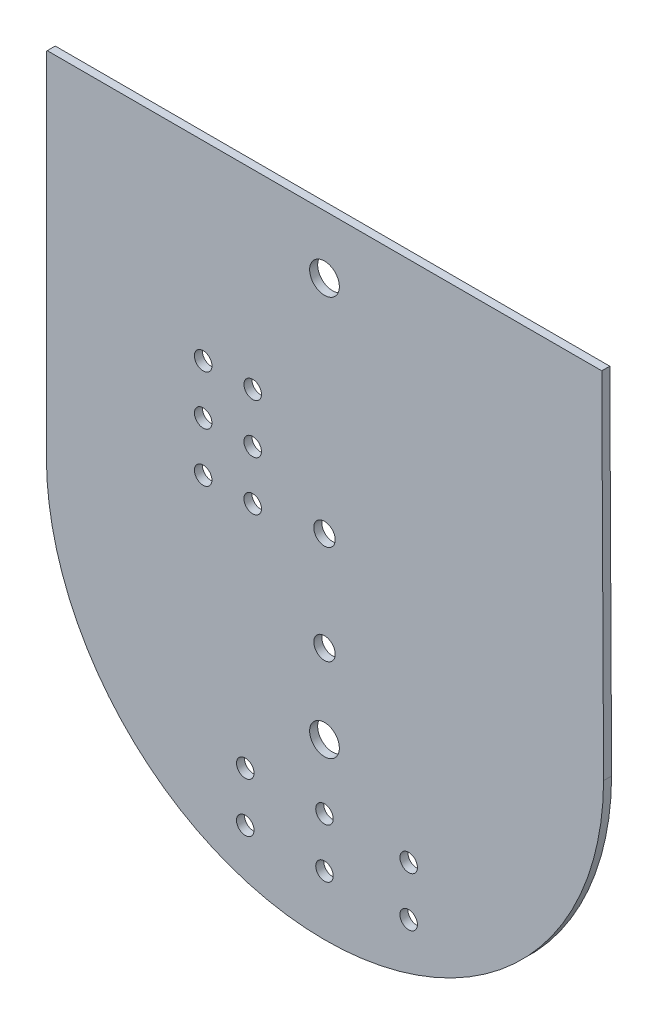
ISO-10303-21;
HEADER;
FILE_DESCRIPTION(('STEP AP214'),'2;1');
FILE_NAME('part.step','',(''),(''),'','','');
FILE_SCHEMA(('AUTOMOTIVE_DESIGN { 1 0 10303 214 1 1 1 1 }'));
ENDSEC;
DATA;
#1=APPLICATION_CONTEXT('core data for automotive mechanical design processes');
#2=APPLICATION_PROTOCOL_DEFINITION('international standard','automotive_design',2000,#1);
#3=PRODUCT_CONTEXT('',#1,'mechanical');
#4=PRODUCT('Part','Part','',(#3));
#5=PRODUCT_RELATED_PRODUCT_CATEGORY('part','',(#4));
#6=PRODUCT_DEFINITION_FORMATION('','',#4);
#7=PRODUCT_DEFINITION_CONTEXT('part definition',#1,'design');
#8=PRODUCT_DEFINITION('design','',#6,#7);
#9=PRODUCT_DEFINITION_SHAPE('','',#8);
#10=(LENGTH_UNIT() NAMED_UNIT(*) SI_UNIT(.MILLI.,.METRE.));
#11=(NAMED_UNIT(*) PLANE_ANGLE_UNIT() SI_UNIT($,.RADIAN.));
#12=(NAMED_UNIT(*) SI_UNIT($,.STERADIAN.) SOLID_ANGLE_UNIT());
#13=UNCERTAINTY_MEASURE_WITH_UNIT(LENGTH_MEASURE(1.E-05),#10,'distance_accuracy_value','');
#14=(GEOMETRIC_REPRESENTATION_CONTEXT(3) GLOBAL_UNCERTAINTY_ASSIGNED_CONTEXT((#13)) GLOBAL_UNIT_ASSIGNED_CONTEXT((#10,
#11,#12)) REPRESENTATION_CONTEXT('',''));
#15=CARTESIAN_POINT('',(0.,0.,0.));
#16=DIRECTION('',(0.,0.,1.));
#17=DIRECTION('',(1.,0.,0.));
#18=AXIS2_PLACEMENT_3D('',#15,#16,#17);
#19=CARTESIAN_POINT('',(1.100000023842,15.112999916077,0.));
#20=DIRECTION('',(0.,0.,1.));
#21=DIRECTION('',(1.,0.,0.));
#22=AXIS2_PLACEMENT_3D('',#19,#20,#21);
#23=PLANE('',#22);
#24=CARTESIAN_POINT('',(15.367,30.1498,0.));
#25=DIRECTION('',(0.,0.,-1.));
#26=DIRECTION('',(-1.,0.,0.));
#27=AXIS2_PLACEMENT_3D('',#24,#25,#26);
#28=CIRCLE('',#27,0.762);
#29=CARTESIAN_POINT('',(14.605,30.1498,0.));
#30=VERTEX_POINT('',#29);
#31=EDGE_CURVE('E152',#30,#30,#28,.T.);
#32=ORIENTED_EDGE('',*,*,#31,.T.);
#33=EDGE_LOOP('',(#32));
#34=FACE_BOUND('',#33,.T.);
#35=CARTESIAN_POINT('',(15.367,9.652,0.));
#36=DIRECTION('',(0.,0.,-1.));
#37=DIRECTION('',(-1.,0.,0.));
#38=AXIS2_PLACEMENT_3D('',#35,#36,#37);
#39=CIRCLE('',#38,0.762);
#40=CARTESIAN_POINT('',(14.605,9.652,0.));
#41=VERTEX_POINT('',#40);
#42=EDGE_CURVE('E155',#41,#41,#39,.T.);
#43=ORIENTED_EDGE('',*,*,#42,.T.);
#44=EDGE_LOOP('',(#43));
#45=FACE_BOUND('',#44,.T.);
#46=CARTESIAN_POINT('',(15.367,18.796,0.));
#47=DIRECTION('',(0.,0.,-1.));
#48=DIRECTION('',(-1.,0.,0.));
#49=AXIS2_PLACEMENT_3D('',#46,#47,#48);
#50=CIRCLE('',#49,0.5499989);
#51=CARTESIAN_POINT('',(14.8170011,18.796,0.));
#52=VERTEX_POINT('',#51);
#53=EDGE_CURVE('E158',#52,#52,#50,.T.);
#54=ORIENTED_EDGE('',*,*,#53,.T.);
#55=EDGE_LOOP('',(#54));
#56=FACE_BOUND('',#55,.T.);
#57=CARTESIAN_POINT('',(15.367,13.716,0.));
#58=DIRECTION('',(0.,0.,-1.));
#59=DIRECTION('',(-1.,0.,0.));
#60=AXIS2_PLACEMENT_3D('',#57,#58,#59);
#61=CIRCLE('',#60,0.5499989);
#62=CARTESIAN_POINT('',(14.8170011,13.716,0.));
#63=VERTEX_POINT('',#62);
#64=EDGE_CURVE('E161',#63,#63,#61,.T.);
#65=ORIENTED_EDGE('',*,*,#64,.T.);
#66=EDGE_LOOP('',(#65));
#67=FACE_BOUND('',#66,.T.);
#68=CARTESIAN_POINT('',(19.685,6.35,0.));
#69=DIRECTION('',(0.,0.,-1.));
#70=DIRECTION('',(-1.,0.,0.));
#71=AXIS2_PLACEMENT_3D('',#68,#69,#70);
#72=CIRCLE('',#71,0.4499991);
#73=CARTESIAN_POINT('',(19.2350009,6.35,0.));
#74=VERTEX_POINT('',#73);
#75=EDGE_CURVE('E164',#74,#74,#72,.T.);
#76=ORIENTED_EDGE('',*,*,#75,.T.);
#77=EDGE_LOOP('',(#76));
#78=FACE_BOUND('',#77,.T.);
#79=CARTESIAN_POINT('',(19.685,3.81,0.));
#80=DIRECTION('',(0.,0.,-1.));
#81=DIRECTION('',(-1.,0.,0.));
#82=AXIS2_PLACEMENT_3D('',#79,#80,#81);
#83=CIRCLE('',#82,0.4499991);
#84=CARTESIAN_POINT('',(19.2350009,3.81,0.));
#85=VERTEX_POINT('',#84);
#86=EDGE_CURVE('E167',#85,#85,#83,.T.);
#87=ORIENTED_EDGE('',*,*,#86,.T.);
#88=EDGE_LOOP('',(#87));
#89=FACE_BOUND('',#88,.T.);
#90=CARTESIAN_POINT('',(15.367,6.35,0.));
#91=DIRECTION('',(0.,0.,-1.));
#92=DIRECTION('',(-1.,0.,0.));
#93=AXIS2_PLACEMENT_3D('',#90,#91,#92);
#94=CIRCLE('',#93,0.4499991);
#95=CARTESIAN_POINT('',(14.9170009,6.35,0.));
#96=VERTEX_POINT('',#95);
#97=EDGE_CURVE('E170',#96,#96,#94,.T.);
#98=ORIENTED_EDGE('',*,*,#97,.T.);
#99=EDGE_LOOP('',(#98));
#100=FACE_BOUND('',#99,.T.);
#101=CARTESIAN_POINT('',(15.367,3.81,0.));
#102=DIRECTION('',(0.,0.,-1.));
#103=DIRECTION('',(-1.,0.,0.));
#104=AXIS2_PLACEMENT_3D('',#101,#102,#103);
#105=CIRCLE('',#104,0.4499991);
#106=CARTESIAN_POINT('',(14.9170009,3.81,0.));
#107=VERTEX_POINT('',#106);
#108=EDGE_CURVE('E173',#107,#107,#105,.T.);
#109=ORIENTED_EDGE('',*,*,#108,.T.);
#110=EDGE_LOOP('',(#109));
#111=FACE_BOUND('',#110,.T.);
#112=CARTESIAN_POINT('',(11.684,23.368,0.));
#113=DIRECTION('',(0.,0.,-1.));
#114=DIRECTION('',(-1.,0.,0.));
#115=AXIS2_PLACEMENT_3D('',#112,#113,#114);
#116=CIRCLE('',#115,0.4499991);
#117=CARTESIAN_POINT('',(11.2340009,23.368,0.));
#118=VERTEX_POINT('',#117);
#119=EDGE_CURVE('E176',#118,#118,#116,.T.);
#120=ORIENTED_EDGE('',*,*,#119,.T.);
#121=EDGE_LOOP('',(#120));
#122=FACE_BOUND('',#121,.T.);
#123=CARTESIAN_POINT('',(11.684,20.828,0.));
#124=DIRECTION('',(0.,0.,-1.));
#125=DIRECTION('',(-1.,0.,0.));
#126=AXIS2_PLACEMENT_3D('',#123,#124,#125);
#127=CIRCLE('',#126,0.4499991);
#128=CARTESIAN_POINT('',(11.2340009,20.828,0.));
#129=VERTEX_POINT('',#128);
#130=EDGE_CURVE('E179',#129,#129,#127,.T.);
#131=ORIENTED_EDGE('',*,*,#130,.T.);
#132=EDGE_LOOP('',(#131));
#133=FACE_BOUND('',#132,.T.);
#134=CARTESIAN_POINT('',(9.144,23.368,0.));
#135=DIRECTION('',(0.,0.,-1.));
#136=DIRECTION('',(-1.,0.,0.));
#137=AXIS2_PLACEMENT_3D('',#134,#135,#136);
#138=CIRCLE('',#137,0.4499991);
#139=CARTESIAN_POINT('',(8.6940009,23.368,0.));
#140=VERTEX_POINT('',#139);
#141=EDGE_CURVE('E182',#140,#140,#138,.T.);
#142=ORIENTED_EDGE('',*,*,#141,.T.);
#143=EDGE_LOOP('',(#142));
#144=FACE_BOUND('',#143,.T.);
#145=CARTESIAN_POINT('',(9.144,20.828,0.));
#146=DIRECTION('',(0.,0.,-1.));
#147=DIRECTION('',(-1.,0.,0.));
#148=AXIS2_PLACEMENT_3D('',#145,#146,#147);
#149=CIRCLE('',#148,0.4499991);
#150=CARTESIAN_POINT('',(8.6940009,20.828,0.));
#151=VERTEX_POINT('',#150);
#152=EDGE_CURVE('E185',#151,#151,#149,.T.);
#153=ORIENTED_EDGE('',*,*,#152,.T.);
#154=EDGE_LOOP('',(#153));
#155=FACE_BOUND('',#154,.T.);
#156=CARTESIAN_POINT('',(11.684,18.288,0.));
#157=DIRECTION('',(0.,0.,-1.));
#158=DIRECTION('',(-1.,0.,0.));
#159=AXIS2_PLACEMENT_3D('',#156,#157,#158);
#160=CIRCLE('',#159,0.4499991);
#161=CARTESIAN_POINT('',(11.2340009,18.288,0.));
#162=VERTEX_POINT('',#161);
#163=EDGE_CURVE('E188',#162,#162,#160,.T.);
#164=ORIENTED_EDGE('',*,*,#163,.T.);
#165=EDGE_LOOP('',(#164));
#166=FACE_BOUND('',#165,.T.);
#167=CARTESIAN_POINT('',(11.303,3.81,0.));
#168=DIRECTION('',(0.,0.,-1.));
#169=DIRECTION('',(-1.,0.,0.));
#170=AXIS2_PLACEMENT_3D('',#167,#168,#169);
#171=CIRCLE('',#170,0.4499991);
#172=CARTESIAN_POINT('',(10.8530009,3.81,0.));
#173=VERTEX_POINT('',#172);
#174=EDGE_CURVE('E191',#173,#173,#171,.T.);
#175=ORIENTED_EDGE('',*,*,#174,.T.);
#176=EDGE_LOOP('',(#175));
#177=FACE_BOUND('',#176,.T.);
#178=CARTESIAN_POINT('',(9.144,18.288,0.));
#179=DIRECTION('',(0.,0.,-1.));
#180=DIRECTION('',(-1.,0.,0.));
#181=AXIS2_PLACEMENT_3D('',#178,#179,#180);
#182=CIRCLE('',#181,0.4499991);
#183=CARTESIAN_POINT('',(8.6940009,18.288,0.));
#184=VERTEX_POINT('',#183);
#185=EDGE_CURVE('E194',#184,#184,#182,.T.);
#186=ORIENTED_EDGE('',*,*,#185,.T.);
#187=EDGE_LOOP('',(#186));
#188=FACE_BOUND('',#187,.T.);
#189=CARTESIAN_POINT('',(11.303,6.35,0.));
#190=DIRECTION('',(0.,0.,-1.));
#191=DIRECTION('',(-1.,0.,0.));
#192=AXIS2_PLACEMENT_3D('',#189,#190,#191);
#193=CIRCLE('',#192,0.4499991);
#194=CARTESIAN_POINT('',(10.8530009,6.35,0.));
#195=VERTEX_POINT('',#194);
#196=EDGE_CURVE('E196',#195,#195,#193,.T.);
#197=ORIENTED_EDGE('',*,*,#196,.T.);
#198=EDGE_LOOP('',(#197));
#199=FACE_BOUND('',#198,.T.);
#200=DIRECTION('',(-0.707112662169091,-0.707100900155091,0.));
#201=VECTOR('',#200,1.);
#202=CARTESIAN_POINT('',(1.100000023842,33.104000091553,0.));
#203=LINE('',#202,#201);
#204=CARTESIAN_POINT('',(1.100000023842,33.104000091553,0.));
#205=VERTEX_POINT('',#204);
#206=CARTESIAN_POINT('',(1.14300000667597,33.146999359131,0.));
#207=VERTEX_POINT('',#206);
#208=EDGE_CURVE('E70',#205,#207,#203,.F.);
#209=ORIENTED_EDGE('',*,*,#208,.F.);
#210=DIRECTION('',(0.,1.,0.));
#211=VECTOR('',#210,1.);
#212=CARTESIAN_POINT('',(1.100000023842,15.112999916077,0.));
#213=LINE('',#212,#211);
#214=CARTESIAN_POINT('',(1.10000002384247,15.050000190735,0.));
#215=VERTEX_POINT('',#214);
#216=EDGE_CURVE('E66',#215,#205,#213,.T.);
#217=ORIENTED_EDGE('',*,*,#216,.F.);
#218=CARTESIAN_POINT('',(15.392570345692,15.049533246585,0.));
#219=DIRECTION('',(0.,0.,-1.));
#220=DIRECTION('',(-1.,0.,0.));
#221=AXIS2_PLACEMENT_3D('',#218,#219,#220);
#222=CIRCLE('',#221,14.292570329477);
#223=CARTESIAN_POINT('',(29.684999465942,14.9860000610113,0.));
#224=VERTEX_POINT('',#223);
#225=EDGE_CURVE('E19',#224,#215,#222,.T.);
#226=ORIENTED_EDGE('',*,*,#225,.F.);
#227=DIRECTION('',(-0.00517584974365303,0.999986605200005,0.));
#228=VECTOR('',#227,1.);
#229=CARTESIAN_POINT('',(29.590999603271,33.146999359131,0.));
#230=LINE('',#229,#228);
#231=CARTESIAN_POINT('',(29.590999603271,33.146999359131,0.));
#232=VERTEX_POINT('',#231);
#233=EDGE_CURVE('E61',#232,#224,#230,.F.);
#234=ORIENTED_EDGE('',*,*,#233,.F.);
#235=DIRECTION('',(1.,0.,0.));
#236=VECTOR('',#235,1.);
#237=CARTESIAN_POINT('',(1.143000006676,33.146999359131,0.));
#238=LINE('',#237,#236);
#239=EDGE_CURVE('E93',#207,#232,#238,.T.);
#240=ORIENTED_EDGE('',*,*,#239,.F.);
#241=EDGE_LOOP('',(#209,#217,#226,#234,#240));
#242=FACE_BOUND('',#241,.T.);
#243=ADVANCED_FACE('F16',(#34,#45,#56,#67,#78,#89,#100,#111,#122,#133,#144,#155,#166,#177,#188,
#199,#242),#23,.T.);
#244=CARTESIAN_POINT('',(15.392570345692,15.049533246585,-0.41148));
#245=DIRECTION('',(0.,0.,-1.));
#246=DIRECTION('',(-1.,0.,0.));
#247=AXIS2_PLACEMENT_3D('',#244,#245,#246);
#248=CYLINDRICAL_SURFACE('',#247,14.292570329477);
#249=DIRECTION('',(0.,0.,-1.));
#250=VECTOR('',#249,1.);
#251=CARTESIAN_POINT('',(1.10000002384263,15.050000190735,-0.41148));
#252=LINE('',#251,#250);
#253=CARTESIAN_POINT('',(1.10000002384247,15.050000190735,-0.41148));
#254=VERTEX_POINT('',#253);
#255=EDGE_CURVE('E80',#215,#254,#252,.T.);
#256=ORIENTED_EDGE('',*,*,#255,.T.);
#257=CARTESIAN_POINT('',(15.392570345692,15.049533246585,-0.41148));
#258=DIRECTION('',(0.,0.,-1.));
#259=DIRECTION('',(-1.,0.,0.));
#260=AXIS2_PLACEMENT_3D('',#257,#258,#259);
#261=CIRCLE('',#260,14.292570329477);
#262=CARTESIAN_POINT('',(29.684999465942,14.9860000610168,-0.41148));
#263=VERTEX_POINT('',#262);
#264=EDGE_CURVE('E149',#254,#263,#261,.F.);
#265=ORIENTED_EDGE('',*,*,#264,.T.);
#266=DIRECTION('',(0.,0.,1.));
#267=VECTOR('',#266,1.);
#268=CARTESIAN_POINT('',(29.6849994659419,14.986000061035,-0.41148));
#269=LINE('',#268,#267);
#270=EDGE_CURVE('E81',#224,#263,#269,.F.);
#271=ORIENTED_EDGE('',*,*,#270,.F.);
#272=ORIENTED_EDGE('',*,*,#225,.T.);
#273=EDGE_LOOP('',(#256,#265,#271,#272));
#274=FACE_BOUND('',#273,.T.);
#275=ADVANCED_FACE('F78',(#274),#248,.T.);
#276=CARTESIAN_POINT('',(29.590999603271,33.146999359131,-0.41148));
#277=DIRECTION('',(0.999986605200005,0.00517584974365303,0.));
#278=DIRECTION('',(-0.00517584974365303,0.999986605200005,0.));
#279=AXIS2_PLACEMENT_3D('',#276,#277,#278);
#280=PLANE('',#279);
#281=ORIENTED_EDGE('',*,*,#270,.T.);
#282=DIRECTION('',(-0.00517584974365881,0.999986605200005,0.));
#283=VECTOR('',#282,1.);
#284=CARTESIAN_POINT('',(29.684999465942,14.986000061035,-0.41148));
#285=LINE('',#284,#283);
#286=CARTESIAN_POINT('',(29.590999603271,33.146999359131,-0.41148));
#287=VERTEX_POINT('',#286);
#288=EDGE_CURVE('E151',#263,#287,#285,.T.);
#289=ORIENTED_EDGE('',*,*,#288,.T.);
#290=DIRECTION('',(0.,0.,1.));
#291=VECTOR('',#290,1.);
#292=CARTESIAN_POINT('',(29.590999603271,33.146999359131,-0.41148));
#293=LINE('',#292,#291);
#294=EDGE_CURVE('E95',#232,#287,#293,.F.);
#295=ORIENTED_EDGE('',*,*,#294,.F.);
#296=ORIENTED_EDGE('',*,*,#233,.T.);
#297=EDGE_LOOP('',(#281,#289,#295,#296));
#298=FACE_BOUND('',#297,.T.);
#299=ADVANCED_FACE('F218',(#298),#280,.T.);
#300=CARTESIAN_POINT('',(1.143000006676,33.146999359131,-0.41148));
#301=DIRECTION('',(0.,1.,0.));
#302=DIRECTION('',(0.,0.,1.));
#303=AXIS2_PLACEMENT_3D('',#300,#301,#302);
#304=PLANE('',#303);
#305=ORIENTED_EDGE('',*,*,#294,.T.);
#306=DIRECTION('',(1.,0.,0.));
#307=VECTOR('',#306,1.);
#308=CARTESIAN_POINT('',(1.100000023842,33.146999359131,-0.41148));
#309=LINE('',#308,#307);
#310=CARTESIAN_POINT('',(1.14300000667597,33.146999359131,-0.41148));
#311=VERTEX_POINT('',#310);
#312=EDGE_CURVE('E207',#287,#311,#309,.F.);
#313=ORIENTED_EDGE('',*,*,#312,.T.);
#314=DIRECTION('',(0.,0.,1.));
#315=VECTOR('',#314,1.);
#316=CARTESIAN_POINT('',(1.14300000667588,33.1469993591311,-0.41148));
#317=LINE('',#316,#315);
#318=EDGE_CURVE('E75',#207,#311,#317,.F.);
#319=ORIENTED_EDGE('',*,*,#318,.F.);
#320=ORIENTED_EDGE('',*,*,#239,.T.);
#321=EDGE_LOOP('',(#305,#313,#319,#320));
#322=FACE_BOUND('',#321,.T.);
#323=ADVANCED_FACE('F213',(#322),#304,.T.);
#324=CARTESIAN_POINT('',(1.100000023842,33.104000091553,-0.41148));
#325=DIRECTION('',(-0.707100900155091,0.707112662169091,0.));
#326=DIRECTION('',(-0.707112662169091,-0.707100900155091,0.));
#327=AXIS2_PLACEMENT_3D('',#324,#325,#326);
#328=PLANE('',#327);
#329=ORIENTED_EDGE('',*,*,#318,.T.);
#330=DIRECTION('',(-0.707112662171089,-0.707100900153094,0.));
#331=VECTOR('',#330,1.);
#332=CARTESIAN_POINT('',(1.143000006676,33.146999359131,-0.41148));
#333=LINE('',#332,#331);
#334=CARTESIAN_POINT('',(1.100000023842,33.104000091553,-0.41148));
#335=VERTEX_POINT('',#334);
#336=EDGE_CURVE('E148',#311,#335,#333,.T.);
#337=ORIENTED_EDGE('',*,*,#336,.T.);
#338=DIRECTION('',(0.,0.,1.));
#339=VECTOR('',#338,1.);
#340=CARTESIAN_POINT('',(1.100000023842,33.104000091553,-0.41148));
#341=LINE('',#340,#339);
#342=EDGE_CURVE('E74',#205,#335,#341,.F.);
#343=ORIENTED_EDGE('',*,*,#342,.F.);
#344=ORIENTED_EDGE('',*,*,#208,.T.);
#345=EDGE_LOOP('',(#329,#337,#343,#344));
#346=FACE_BOUND('',#345,.T.);
#347=ADVANCED_FACE('F224',(#346),#328,.T.);
#348=CARTESIAN_POINT('',(1.100000023842,15.112999916077,-0.41148));
#349=DIRECTION('',(-1.,0.,0.));
#350=DIRECTION('',(0.,0.,1.));
#351=AXIS2_PLACEMENT_3D('',#348,#349,#350);
#352=PLANE('',#351);
#353=ORIENTED_EDGE('',*,*,#342,.T.);
#354=DIRECTION('',(0.,1.,0.));
#355=VECTOR('',#354,1.);
#356=CARTESIAN_POINT('',(1.100000023842,15.112999916077,-0.41148));
#357=LINE('',#356,#355);
#358=EDGE_CURVE('E34',#335,#254,#357,.F.);
#359=ORIENTED_EDGE('',*,*,#358,.T.);
#360=ORIENTED_EDGE('',*,*,#255,.F.);
#361=ORIENTED_EDGE('',*,*,#216,.T.);
#362=EDGE_LOOP('',(#353,#359,#360,#361));
#363=FACE_BOUND('',#362,.T.);
#364=ADVANCED_FACE('F82',(#363),#352,.T.);
#365=CARTESIAN_POINT('',(11.303,6.35,-0.41148));
#366=DIRECTION('',(0.,0.,-1.));
#367=DIRECTION('',(-1.,0.,0.));
#368=AXIS2_PLACEMENT_3D('',#365,#366,#367);
#369=CYLINDRICAL_SURFACE('',#368,0.4499991);
#370=ORIENTED_EDGE('',*,*,#196,.F.);
#371=EDGE_LOOP('',(#370));
#372=FACE_BOUND('',#371,.T.);
#373=CARTESIAN_POINT('',(11.303,6.35,-0.41148));
#374=DIRECTION('',(0.,0.,-1.));
#375=DIRECTION('',(-1.,0.,0.));
#376=AXIS2_PLACEMENT_3D('',#373,#374,#375);
#377=CIRCLE('',#376,0.4499991);
#378=CARTESIAN_POINT('',(10.8530009,6.35,-0.41148));
#379=VERTEX_POINT('',#378);
#380=EDGE_CURVE('E145',#379,#379,#377,.T.);
#381=ORIENTED_EDGE('',*,*,#380,.T.);
#382=EDGE_LOOP('',(#381));
#383=FACE_BOUND('',#382,.T.);
#384=ADVANCED_FACE('F232',(#372,#383),#369,.F.);
#385=CARTESIAN_POINT('',(9.144,18.288,-0.41148));
#386=DIRECTION('',(0.,0.,-1.));
#387=DIRECTION('',(-1.,0.,0.));
#388=AXIS2_PLACEMENT_3D('',#385,#386,#387);
#389=CYLINDRICAL_SURFACE('',#388,0.4499991);
#390=ORIENTED_EDGE('',*,*,#185,.F.);
#391=EDGE_LOOP('',(#390));
#392=FACE_BOUND('',#391,.T.);
#393=CARTESIAN_POINT('',(9.144,18.288,-0.41148));
#394=DIRECTION('',(0.,0.,-1.));
#395=DIRECTION('',(-1.,0.,0.));
#396=AXIS2_PLACEMENT_3D('',#393,#394,#395);
#397=CIRCLE('',#396,0.4499991);
#398=CARTESIAN_POINT('',(8.6940009,18.288,-0.41148));
#399=VERTEX_POINT('',#398);
#400=EDGE_CURVE('E142',#399,#399,#397,.T.);
#401=ORIENTED_EDGE('',*,*,#400,.T.);
#402=EDGE_LOOP('',(#401));
#403=FACE_BOUND('',#402,.T.);
#404=ADVANCED_FACE('F298',(#392,#403),#389,.F.);
#405=CARTESIAN_POINT('',(11.303,3.81,-0.41148));
#406=DIRECTION('',(0.,0.,-1.));
#407=DIRECTION('',(-1.,0.,0.));
#408=AXIS2_PLACEMENT_3D('',#405,#406,#407);
#409=CYLINDRICAL_SURFACE('',#408,0.4499991);
#410=ORIENTED_EDGE('',*,*,#174,.F.);
#411=EDGE_LOOP('',(#410));
#412=FACE_BOUND('',#411,.T.);
#413=CARTESIAN_POINT('',(11.303,3.81,-0.41148));
#414=DIRECTION('',(0.,0.,-1.));
#415=DIRECTION('',(-1.,0.,0.));
#416=AXIS2_PLACEMENT_3D('',#413,#414,#415);
#417=CIRCLE('',#416,0.4499991);
#418=CARTESIAN_POINT('',(10.8530009,3.81,-0.41148));
#419=VERTEX_POINT('',#418);
#420=EDGE_CURVE('E139',#419,#419,#417,.T.);
#421=ORIENTED_EDGE('',*,*,#420,.T.);
#422=EDGE_LOOP('',(#421));
#423=FACE_BOUND('',#422,.T.);
#424=ADVANCED_FACE('F294',(#412,#423),#409,.F.);
#425=CARTESIAN_POINT('',(11.684,18.288,-0.41148));
#426=DIRECTION('',(0.,0.,-1.));
#427=DIRECTION('',(-1.,0.,0.));
#428=AXIS2_PLACEMENT_3D('',#425,#426,#427);
#429=CYLINDRICAL_SURFACE('',#428,0.4499991);
#430=ORIENTED_EDGE('',*,*,#163,.F.);
#431=EDGE_LOOP('',(#430));
#432=FACE_BOUND('',#431,.T.);
#433=CARTESIAN_POINT('',(11.684,18.288,-0.41148));
#434=DIRECTION('',(0.,0.,-1.));
#435=DIRECTION('',(-1.,0.,0.));
#436=AXIS2_PLACEMENT_3D('',#433,#434,#435);
#437=CIRCLE('',#436,0.4499991);
#438=CARTESIAN_POINT('',(11.2340009,18.288,-0.41148));
#439=VERTEX_POINT('',#438);
#440=EDGE_CURVE('E136',#439,#439,#437,.T.);
#441=ORIENTED_EDGE('',*,*,#440,.T.);
#442=EDGE_LOOP('',(#441));
#443=FACE_BOUND('',#442,.T.);
#444=ADVANCED_FACE('F290',(#432,#443),#429,.F.);
#445=CARTESIAN_POINT('',(9.144,20.828,-0.41148));
#446=DIRECTION('',(0.,0.,-1.));
#447=DIRECTION('',(-1.,0.,0.));
#448=AXIS2_PLACEMENT_3D('',#445,#446,#447);
#449=CYLINDRICAL_SURFACE('',#448,0.4499991);
#450=ORIENTED_EDGE('',*,*,#152,.F.);
#451=EDGE_LOOP('',(#450));
#452=FACE_BOUND('',#451,.T.);
#453=CARTESIAN_POINT('',(9.144,20.828,-0.41148));
#454=DIRECTION('',(0.,0.,-1.));
#455=DIRECTION('',(-1.,0.,0.));
#456=AXIS2_PLACEMENT_3D('',#453,#454,#455);
#457=CIRCLE('',#456,0.4499991);
#458=CARTESIAN_POINT('',(8.6940009,20.828,-0.41148));
#459=VERTEX_POINT('',#458);
#460=EDGE_CURVE('E133',#459,#459,#457,.T.);
#461=ORIENTED_EDGE('',*,*,#460,.T.);
#462=EDGE_LOOP('',(#461));
#463=FACE_BOUND('',#462,.T.);
#464=ADVANCED_FACE('F286',(#452,#463),#449,.F.);
#465=CARTESIAN_POINT('',(9.144,23.368,-0.41148));
#466=DIRECTION('',(0.,0.,-1.));
#467=DIRECTION('',(-1.,0.,0.));
#468=AXIS2_PLACEMENT_3D('',#465,#466,#467);
#469=CYLINDRICAL_SURFACE('',#468,0.4499991);
#470=ORIENTED_EDGE('',*,*,#141,.F.);
#471=EDGE_LOOP('',(#470));
#472=FACE_BOUND('',#471,.T.);
#473=CARTESIAN_POINT('',(9.144,23.368,-0.41148));
#474=DIRECTION('',(0.,0.,-1.));
#475=DIRECTION('',(-1.,0.,0.));
#476=AXIS2_PLACEMENT_3D('',#473,#474,#475);
#477=CIRCLE('',#476,0.4499991);
#478=CARTESIAN_POINT('',(8.6940009,23.368,-0.41148));
#479=VERTEX_POINT('',#478);
#480=EDGE_CURVE('E130',#479,#479,#477,.T.);
#481=ORIENTED_EDGE('',*,*,#480,.T.);
#482=EDGE_LOOP('',(#481));
#483=FACE_BOUND('',#482,.T.);
#484=ADVANCED_FACE('F282',(#472,#483),#469,.F.);
#485=CARTESIAN_POINT('',(11.684,20.828,-0.41148));
#486=DIRECTION('',(0.,0.,-1.));
#487=DIRECTION('',(-1.,0.,0.));
#488=AXIS2_PLACEMENT_3D('',#485,#486,#487);
#489=CYLINDRICAL_SURFACE('',#488,0.4499991);
#490=ORIENTED_EDGE('',*,*,#130,.F.);
#491=EDGE_LOOP('',(#490));
#492=FACE_BOUND('',#491,.T.);
#493=CARTESIAN_POINT('',(11.684,20.828,-0.41148));
#494=DIRECTION('',(0.,0.,-1.));
#495=DIRECTION('',(-1.,0.,0.));
#496=AXIS2_PLACEMENT_3D('',#493,#494,#495);
#497=CIRCLE('',#496,0.4499991);
#498=CARTESIAN_POINT('',(11.2340009,20.828,-0.41148));
#499=VERTEX_POINT('',#498);
#500=EDGE_CURVE('E127',#499,#499,#497,.T.);
#501=ORIENTED_EDGE('',*,*,#500,.T.);
#502=EDGE_LOOP('',(#501));
#503=FACE_BOUND('',#502,.T.);
#504=ADVANCED_FACE('F278',(#492,#503),#489,.F.);
#505=CARTESIAN_POINT('',(11.684,23.368,-0.41148));
#506=DIRECTION('',(0.,0.,-1.));
#507=DIRECTION('',(-1.,0.,0.));
#508=AXIS2_PLACEMENT_3D('',#505,#506,#507);
#509=CYLINDRICAL_SURFACE('',#508,0.4499991);
#510=ORIENTED_EDGE('',*,*,#119,.F.);
#511=EDGE_LOOP('',(#510));
#512=FACE_BOUND('',#511,.T.);
#513=CARTESIAN_POINT('',(11.684,23.368,-0.41148));
#514=DIRECTION('',(0.,0.,-1.));
#515=DIRECTION('',(-1.,0.,0.));
#516=AXIS2_PLACEMENT_3D('',#513,#514,#515);
#517=CIRCLE('',#516,0.4499991);
#518=CARTESIAN_POINT('',(11.2340009,23.368,-0.41148));
#519=VERTEX_POINT('',#518);
#520=EDGE_CURVE('E124',#519,#519,#517,.T.);
#521=ORIENTED_EDGE('',*,*,#520,.T.);
#522=EDGE_LOOP('',(#521));
#523=FACE_BOUND('',#522,.T.);
#524=ADVANCED_FACE('F274',(#512,#523),#509,.F.);
#525=CARTESIAN_POINT('',(15.367,3.81,-0.41148));
#526=DIRECTION('',(0.,0.,-1.));
#527=DIRECTION('',(-1.,0.,0.));
#528=AXIS2_PLACEMENT_3D('',#525,#526,#527);
#529=CYLINDRICAL_SURFACE('',#528,0.4499991);
#530=ORIENTED_EDGE('',*,*,#108,.F.);
#531=EDGE_LOOP('',(#530));
#532=FACE_BOUND('',#531,.T.);
#533=CARTESIAN_POINT('',(15.367,3.81,-0.41148));
#534=DIRECTION('',(0.,0.,-1.));
#535=DIRECTION('',(-1.,0.,0.));
#536=AXIS2_PLACEMENT_3D('',#533,#534,#535);
#537=CIRCLE('',#536,0.4499991);
#538=CARTESIAN_POINT('',(14.9170009,3.81,-0.41148));
#539=VERTEX_POINT('',#538);
#540=EDGE_CURVE('E121',#539,#539,#537,.T.);
#541=ORIENTED_EDGE('',*,*,#540,.T.);
#542=EDGE_LOOP('',(#541));
#543=FACE_BOUND('',#542,.T.);
#544=ADVANCED_FACE('F270',(#532,#543),#529,.F.);
#545=CARTESIAN_POINT('',(15.367,6.35,-0.41148));
#546=DIRECTION('',(0.,0.,-1.));
#547=DIRECTION('',(-1.,0.,0.));
#548=AXIS2_PLACEMENT_3D('',#545,#546,#547);
#549=CYLINDRICAL_SURFACE('',#548,0.4499991);
#550=ORIENTED_EDGE('',*,*,#97,.F.);
#551=EDGE_LOOP('',(#550));
#552=FACE_BOUND('',#551,.T.);
#553=CARTESIAN_POINT('',(15.367,6.35,-0.41148));
#554=DIRECTION('',(0.,0.,-1.));
#555=DIRECTION('',(-1.,0.,0.));
#556=AXIS2_PLACEMENT_3D('',#553,#554,#555);
#557=CIRCLE('',#556,0.4499991);
#558=CARTESIAN_POINT('',(14.9170009,6.35,-0.41148));
#559=VERTEX_POINT('',#558);
#560=EDGE_CURVE('E118',#559,#559,#557,.T.);
#561=ORIENTED_EDGE('',*,*,#560,.T.);
#562=EDGE_LOOP('',(#561));
#563=FACE_BOUND('',#562,.T.);
#564=ADVANCED_FACE('F266',(#552,#563),#549,.F.);
#565=CARTESIAN_POINT('',(19.685,3.81,-0.41148));
#566=DIRECTION('',(0.,0.,-1.));
#567=DIRECTION('',(-1.,0.,0.));
#568=AXIS2_PLACEMENT_3D('',#565,#566,#567);
#569=CYLINDRICAL_SURFACE('',#568,0.4499991);
#570=ORIENTED_EDGE('',*,*,#86,.F.);
#571=EDGE_LOOP('',(#570));
#572=FACE_BOUND('',#571,.T.);
#573=CARTESIAN_POINT('',(19.685,3.81,-0.41148));
#574=DIRECTION('',(0.,0.,-1.));
#575=DIRECTION('',(-1.,0.,0.));
#576=AXIS2_PLACEMENT_3D('',#573,#574,#575);
#577=CIRCLE('',#576,0.4499991);
#578=CARTESIAN_POINT('',(19.2350009,3.81,-0.41148));
#579=VERTEX_POINT('',#578);
#580=EDGE_CURVE('E115',#579,#579,#577,.T.);
#581=ORIENTED_EDGE('',*,*,#580,.T.);
#582=EDGE_LOOP('',(#581));
#583=FACE_BOUND('',#582,.T.);
#584=ADVANCED_FACE('F262',(#572,#583),#569,.F.);
#585=CARTESIAN_POINT('',(19.685,6.35,-0.41148));
#586=DIRECTION('',(0.,0.,-1.));
#587=DIRECTION('',(-1.,0.,0.));
#588=AXIS2_PLACEMENT_3D('',#585,#586,#587);
#589=CYLINDRICAL_SURFACE('',#588,0.4499991);
#590=ORIENTED_EDGE('',*,*,#75,.F.);
#591=EDGE_LOOP('',(#590));
#592=FACE_BOUND('',#591,.T.);
#593=CARTESIAN_POINT('',(19.685,6.35,-0.41148));
#594=DIRECTION('',(0.,0.,-1.));
#595=DIRECTION('',(-1.,0.,0.));
#596=AXIS2_PLACEMENT_3D('',#593,#594,#595);
#597=CIRCLE('',#596,0.4499991);
#598=CARTESIAN_POINT('',(19.2350009,6.35,-0.41148));
#599=VERTEX_POINT('',#598);
#600=EDGE_CURVE('E112',#599,#599,#597,.T.);
#601=ORIENTED_EDGE('',*,*,#600,.T.);
#602=EDGE_LOOP('',(#601));
#603=FACE_BOUND('',#602,.T.);
#604=ADVANCED_FACE('F258',(#592,#603),#589,.F.);
#605=CARTESIAN_POINT('',(15.367,13.716,-0.41148));
#606=DIRECTION('',(0.,0.,-1.));
#607=DIRECTION('',(-1.,0.,0.));
#608=AXIS2_PLACEMENT_3D('',#605,#606,#607);
#609=CYLINDRICAL_SURFACE('',#608,0.5499989);
#610=ORIENTED_EDGE('',*,*,#64,.F.);
#611=EDGE_LOOP('',(#610));
#612=FACE_BOUND('',#611,.T.);
#613=CARTESIAN_POINT('',(15.367,13.716,-0.41148));
#614=DIRECTION('',(0.,0.,-1.));
#615=DIRECTION('',(-1.,0.,0.));
#616=AXIS2_PLACEMENT_3D('',#613,#614,#615);
#617=CIRCLE('',#616,0.5499989);
#618=CARTESIAN_POINT('',(14.8170011,13.716,-0.41148));
#619=VERTEX_POINT('',#618);
#620=EDGE_CURVE('E109',#619,#619,#617,.T.);
#621=ORIENTED_EDGE('',*,*,#620,.T.);
#622=EDGE_LOOP('',(#621));
#623=FACE_BOUND('',#622,.T.);
#624=ADVANCED_FACE('F254',(#612,#623),#609,.F.);
#625=CARTESIAN_POINT('',(15.367,18.796,-0.41148));
#626=DIRECTION('',(0.,0.,-1.));
#627=DIRECTION('',(-1.,0.,0.));
#628=AXIS2_PLACEMENT_3D('',#625,#626,#627);
#629=CYLINDRICAL_SURFACE('',#628,0.5499989);
#630=ORIENTED_EDGE('',*,*,#53,.F.);
#631=EDGE_LOOP('',(#630));
#632=FACE_BOUND('',#631,.T.);
#633=CARTESIAN_POINT('',(15.367,18.796,-0.41148));
#634=DIRECTION('',(0.,0.,-1.));
#635=DIRECTION('',(-1.,0.,0.));
#636=AXIS2_PLACEMENT_3D('',#633,#634,#635);
#637=CIRCLE('',#636,0.5499989);
#638=CARTESIAN_POINT('',(14.8170011,18.796,-0.41148));
#639=VERTEX_POINT('',#638);
#640=EDGE_CURVE('E106',#639,#639,#637,.T.);
#641=ORIENTED_EDGE('',*,*,#640,.T.);
#642=EDGE_LOOP('',(#641));
#643=FACE_BOUND('',#642,.T.);
#644=ADVANCED_FACE('F250',(#632,#643),#629,.F.);
#645=CARTESIAN_POINT('',(15.367,9.652,-0.41148));
#646=DIRECTION('',(0.,0.,-1.));
#647=DIRECTION('',(-1.,0.,0.));
#648=AXIS2_PLACEMENT_3D('',#645,#646,#647);
#649=CYLINDRICAL_SURFACE('',#648,0.762);
#650=ORIENTED_EDGE('',*,*,#42,.F.);
#651=EDGE_LOOP('',(#650));
#652=FACE_BOUND('',#651,.T.);
#653=CARTESIAN_POINT('',(15.367,9.652,-0.41148));
#654=DIRECTION('',(0.,0.,-1.));
#655=DIRECTION('',(-1.,0.,0.));
#656=AXIS2_PLACEMENT_3D('',#653,#654,#655);
#657=CIRCLE('',#656,0.762);
#658=CARTESIAN_POINT('',(14.605,9.652,-0.41148));
#659=VERTEX_POINT('',#658);
#660=EDGE_CURVE('E25',#659,#659,#657,.T.);
#661=ORIENTED_EDGE('',*,*,#660,.T.);
#662=EDGE_LOOP('',(#661));
#663=FACE_BOUND('',#662,.T.);
#664=ADVANCED_FACE('F242',(#652,#663),#649,.F.);
#665=CARTESIAN_POINT('',(15.367,30.1498,-0.41148));
#666=DIRECTION('',(0.,0.,-1.));
#667=DIRECTION('',(-1.,0.,0.));
#668=AXIS2_PLACEMENT_3D('',#665,#666,#667);
#669=CYLINDRICAL_SURFACE('',#668,0.762);
#670=ORIENTED_EDGE('',*,*,#31,.F.);
#671=EDGE_LOOP('',(#670));
#672=FACE_BOUND('',#671,.T.);
#673=CARTESIAN_POINT('',(15.367,30.1498,-0.41148));
#674=DIRECTION('',(0.,0.,-1.));
#675=DIRECTION('',(-1.,0.,0.));
#676=AXIS2_PLACEMENT_3D('',#673,#674,#675);
#677=CIRCLE('',#676,0.762);
#678=CARTESIAN_POINT('',(14.605,30.1498,-0.41148));
#679=VERTEX_POINT('',#678);
#680=EDGE_CURVE('E11',#679,#679,#677,.T.);
#681=ORIENTED_EDGE('',*,*,#680,.T.);
#682=EDGE_LOOP('',(#681));
#683=FACE_BOUND('',#682,.T.);
#684=ADVANCED_FACE('F236',(#672,#683),#669,.F.);
#685=CARTESIAN_POINT('',(1.100000023842,15.112999916077,-0.41148));
#686=DIRECTION('',(0.,0.,1.));
#687=DIRECTION('',(1.,0.,0.));
#688=AXIS2_PLACEMENT_3D('',#685,#686,#687);
#689=PLANE('',#688);
#690=ORIENTED_EDGE('',*,*,#680,.F.);
#691=EDGE_LOOP('',(#690));
#692=FACE_BOUND('',#691,.T.);
#693=ORIENTED_EDGE('',*,*,#660,.F.);
#694=EDGE_LOOP('',(#693));
#695=FACE_BOUND('',#694,.T.);
#696=ORIENTED_EDGE('',*,*,#640,.F.);
#697=EDGE_LOOP('',(#696));
#698=FACE_BOUND('',#697,.T.);
#699=ORIENTED_EDGE('',*,*,#620,.F.);
#700=EDGE_LOOP('',(#699));
#701=FACE_BOUND('',#700,.T.);
#702=ORIENTED_EDGE('',*,*,#600,.F.);
#703=EDGE_LOOP('',(#702));
#704=FACE_BOUND('',#703,.T.);
#705=ORIENTED_EDGE('',*,*,#580,.F.);
#706=EDGE_LOOP('',(#705));
#707=FACE_BOUND('',#706,.T.);
#708=ORIENTED_EDGE('',*,*,#560,.F.);
#709=EDGE_LOOP('',(#708));
#710=FACE_BOUND('',#709,.T.);
#711=ORIENTED_EDGE('',*,*,#540,.F.);
#712=EDGE_LOOP('',(#711));
#713=FACE_BOUND('',#712,.T.);
#714=ORIENTED_EDGE('',*,*,#520,.F.);
#715=EDGE_LOOP('',(#714));
#716=FACE_BOUND('',#715,.T.);
#717=ORIENTED_EDGE('',*,*,#500,.F.);
#718=EDGE_LOOP('',(#717));
#719=FACE_BOUND('',#718,.T.);
#720=ORIENTED_EDGE('',*,*,#480,.F.);
#721=EDGE_LOOP('',(#720));
#722=FACE_BOUND('',#721,.T.);
#723=ORIENTED_EDGE('',*,*,#460,.F.);
#724=EDGE_LOOP('',(#723));
#725=FACE_BOUND('',#724,.T.);
#726=ORIENTED_EDGE('',*,*,#440,.F.);
#727=EDGE_LOOP('',(#726));
#728=FACE_BOUND('',#727,.T.);
#729=ORIENTED_EDGE('',*,*,#420,.F.);
#730=EDGE_LOOP('',(#729));
#731=FACE_BOUND('',#730,.T.);
#732=ORIENTED_EDGE('',*,*,#400,.F.);
#733=EDGE_LOOP('',(#732));
#734=FACE_BOUND('',#733,.T.);
#735=ORIENTED_EDGE('',*,*,#380,.F.);
#736=EDGE_LOOP('',(#735));
#737=FACE_BOUND('',#736,.T.);
#738=ORIENTED_EDGE('',*,*,#336,.F.);
#739=ORIENTED_EDGE('',*,*,#312,.F.);
#740=ORIENTED_EDGE('',*,*,#288,.F.);
#741=ORIENTED_EDGE('',*,*,#264,.F.);
#742=ORIENTED_EDGE('',*,*,#358,.F.);
#743=EDGE_LOOP('',(#738,#739,#740,#741,#742));
#744=FACE_BOUND('',#743,.T.);
#745=ADVANCED_FACE('F217',(#692,#695,#698,#701,#704,#707,#710,#713,#716,#719,#722,#725,#728,
#731,#734,#737,#744),#689,.F.);
#746=CLOSED_SHELL('',(#243,#275,#299,#323,#347,#364,#384,#404,#424,#444,#464,#484,#504,#524,
#544,#564,#584,#604,#624,#644,#664,#684,#745));
#747=MANIFOLD_SOLID_BREP('B1',#746);
#748=ADVANCED_BREP_SHAPE_REPRESENTATION('',(#18,#747),#14);
#749=SHAPE_DEFINITION_REPRESENTATION(#9,#748);
ENDSEC;
END-ISO-10303-21;
